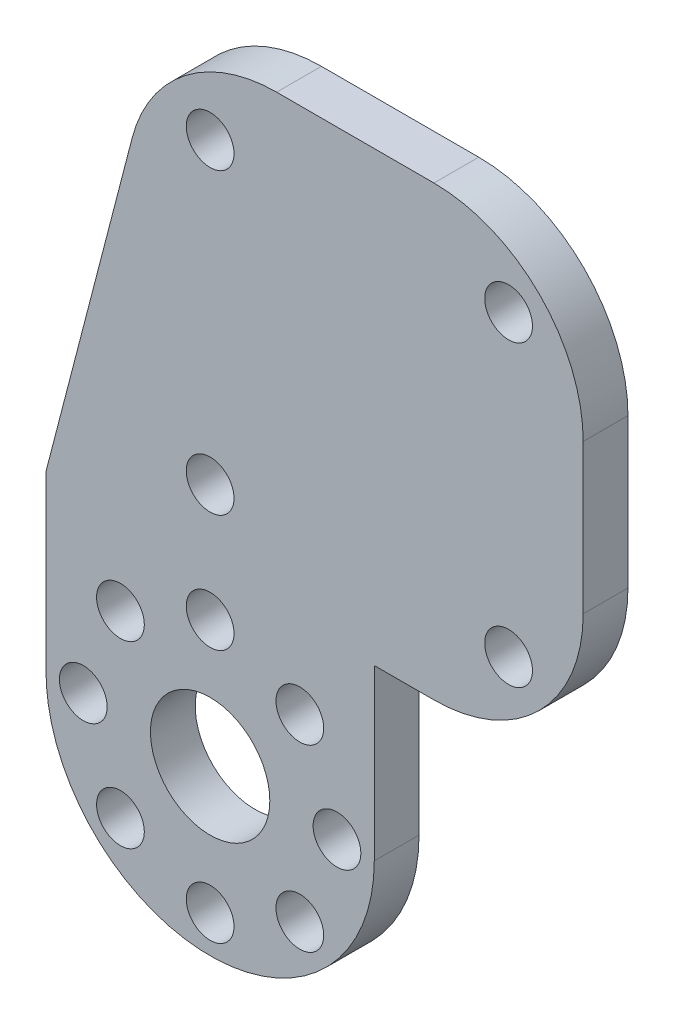
ISO-10303-21;
HEADER;
FILE_DESCRIPTION(('STEP AP214'),'2;1');
FILE_NAME('part.step','',(''),(''),'','','');
FILE_SCHEMA(('AUTOMOTIVE_DESIGN { 1 0 10303 214 1 1 1 1 }'));
ENDSEC;
DATA;
#1=APPLICATION_CONTEXT('core data for automotive mechanical design processes');
#2=APPLICATION_PROTOCOL_DEFINITION('international standard','automotive_design',2000,#1);
#3=PRODUCT_CONTEXT('',#1,'mechanical');
#4=PRODUCT('Part','Part','',(#3));
#5=PRODUCT_RELATED_PRODUCT_CATEGORY('part','',(#4));
#6=PRODUCT_DEFINITION_FORMATION('','',#4);
#7=PRODUCT_DEFINITION_CONTEXT('part definition',#1,'design');
#8=PRODUCT_DEFINITION('design','',#6,#7);
#9=PRODUCT_DEFINITION_SHAPE('','',#8);
#10=(LENGTH_UNIT() NAMED_UNIT(*) SI_UNIT(.MILLI.,.METRE.));
#11=(NAMED_UNIT(*) PLANE_ANGLE_UNIT() SI_UNIT($,.RADIAN.));
#12=(NAMED_UNIT(*) SI_UNIT($,.STERADIAN.) SOLID_ANGLE_UNIT());
#13=UNCERTAINTY_MEASURE_WITH_UNIT(LENGTH_MEASURE(1.E-05),#10,'distance_accuracy_value','');
#14=(GEOMETRIC_REPRESENTATION_CONTEXT(3) GLOBAL_UNCERTAINTY_ASSIGNED_CONTEXT((#13)) GLOBAL_UNIT_ASSIGNED_CONTEXT((#10,
#11,#12)) REPRESENTATION_CONTEXT('',''));
#15=CARTESIAN_POINT('',(0.,0.,0.));
#16=DIRECTION('',(0.,0.,1.));
#17=DIRECTION('',(1.,0.,0.));
#18=AXIS2_PLACEMENT_3D('',#15,#16,#17);
#19=CARTESIAN_POINT('',(15.,5.,3.));
#20=DIRECTION('',(0.,0.,1.));
#21=DIRECTION('',(1.,0.,0.));
#22=AXIS2_PLACEMENT_3D('',#19,#20,#21);
#23=CYLINDRICAL_SURFACE('',#22,10.);
#24=DIRECTION('',(0.,0.,1.));
#25=VECTOR('',#24,1.);
#26=CARTESIAN_POINT('',(14.9999999999999,-5.,3.));
#27=LINE('',#26,#25);
#28=CARTESIAN_POINT('',(14.9999999999999,-5.,0.));
#29=VERTEX_POINT('',#28);
#30=CARTESIAN_POINT('',(14.9999999999999,-5.,3.));
#31=VERTEX_POINT('',#30);
#32=EDGE_CURVE('E11',#29,#31,#27,.T.);
#33=ORIENTED_EDGE('',*,*,#32,.F.);
#34=CARTESIAN_POINT('',(15.,5.,0.));
#35=DIRECTION('',(0.,0.,1.));
#36=DIRECTION('',(1.,0.,0.));
#37=AXIS2_PLACEMENT_3D('',#34,#35,#36);
#38=CIRCLE('',#37,10.);
#39=CARTESIAN_POINT('',(25.,5.,0.));
#40=VERTEX_POINT('',#39);
#41=EDGE_CURVE('E112',#29,#40,#38,.T.);
#42=ORIENTED_EDGE('',*,*,#41,.T.);
#43=DIRECTION('',(0.,0.,1.));
#44=VECTOR('',#43,1.);
#45=CARTESIAN_POINT('',(25.,5.,3.));
#46=LINE('',#45,#44);
#47=CARTESIAN_POINT('',(25.,5.,3.));
#48=VERTEX_POINT('',#47);
#49=EDGE_CURVE('E47',#40,#48,#46,.T.);
#50=ORIENTED_EDGE('',*,*,#49,.T.);
#51=CARTESIAN_POINT('',(15.,5.,3.));
#52=DIRECTION('',(0.,0.,1.));
#53=DIRECTION('',(1.,0.,0.));
#54=AXIS2_PLACEMENT_3D('',#51,#52,#53);
#55=CIRCLE('',#54,10.);
#56=EDGE_CURVE('E187',#31,#48,#55,.T.);
#57=ORIENTED_EDGE('',*,*,#56,.F.);
#58=EDGE_LOOP('',(#33,#42,#50,#57));
#59=FACE_BOUND('',#58,.T.);
#60=ADVANCED_FACE('F37',(#59),#23,.T.);
#61=CARTESIAN_POINT('',(25.,14.9999999999999,3.));
#62=DIRECTION('',(1.,0.,0.));
#63=DIRECTION('',(0.,1.,0.));
#64=AXIS2_PLACEMENT_3D('',#61,#62,#63);
#65=PLANE('',#64);
#66=ORIENTED_EDGE('',*,*,#49,.F.);
#67=DIRECTION('',(0.,1.,0.));
#68=VECTOR('',#67,1.);
#69=CARTESIAN_POINT('',(25.,-16.35,0.));
#70=LINE('',#69,#68);
#71=CARTESIAN_POINT('',(25.,14.9999999999999,0.));
#72=VERTEX_POINT('',#71);
#73=EDGE_CURVE('E140',#40,#72,#70,.T.);
#74=ORIENTED_EDGE('',*,*,#73,.T.);
#75=DIRECTION('',(0.,0.,1.));
#76=VECTOR('',#75,1.);
#77=CARTESIAN_POINT('',(25.,14.9999999999999,3.));
#78=LINE('',#77,#76);
#79=CARTESIAN_POINT('',(25.,14.9999999999999,3.));
#80=VERTEX_POINT('',#79);
#81=EDGE_CURVE('E180',#72,#80,#78,.T.);
#82=ORIENTED_EDGE('',*,*,#81,.T.);
#83=DIRECTION('',(0.,1.,0.));
#84=VECTOR('',#83,1.);
#85=CARTESIAN_POINT('',(25.,14.9999999999999,3.));
#86=LINE('',#85,#84);
#87=EDGE_CURVE('E197',#48,#80,#86,.T.);
#88=ORIENTED_EDGE('',*,*,#87,.F.);
#89=EDGE_LOOP('',(#66,#74,#82,#88));
#90=FACE_BOUND('',#89,.T.);
#91=ADVANCED_FACE('F200',(#90),#65,.T.);
#92=CARTESIAN_POINT('',(15.,15.,3.));
#93=DIRECTION('',(0.,0.,1.));
#94=DIRECTION('',(1.,0.,0.));
#95=AXIS2_PLACEMENT_3D('',#92,#93,#94);
#96=CYLINDRICAL_SURFACE('',#95,10.);
#97=ORIENTED_EDGE('',*,*,#81,.F.);
#98=CARTESIAN_POINT('',(15.,15.,0.));
#99=DIRECTION('',(0.,0.,1.));
#100=DIRECTION('',(1.,0.,0.));
#101=AXIS2_PLACEMENT_3D('',#98,#99,#100);
#102=CIRCLE('',#101,10.);
#103=CARTESIAN_POINT('',(14.9999999999999,25.,0.));
#104=VERTEX_POINT('',#103);
#105=EDGE_CURVE('E137',#72,#104,#102,.T.);
#106=ORIENTED_EDGE('',*,*,#105,.T.);
#107=DIRECTION('',(0.,0.,1.));
#108=VECTOR('',#107,1.);
#109=CARTESIAN_POINT('',(14.9999999999999,25.,3.));
#110=LINE('',#109,#108);
#111=CARTESIAN_POINT('',(14.9999999999999,25.,3.));
#112=VERTEX_POINT('',#111);
#113=EDGE_CURVE('E177',#104,#112,#110,.T.);
#114=ORIENTED_EDGE('',*,*,#113,.T.);
#115=CARTESIAN_POINT('',(15.,15.,3.));
#116=DIRECTION('',(0.,0.,1.));
#117=DIRECTION('',(-1.,0.,0.));
#118=AXIS2_PLACEMENT_3D('',#115,#116,#117);
#119=CIRCLE('',#118,10.);
#120=EDGE_CURVE('E201',#80,#112,#119,.T.);
#121=ORIENTED_EDGE('',*,*,#120,.F.);
#122=EDGE_LOOP('',(#97,#106,#114,#121));
#123=FACE_BOUND('',#122,.T.);
#124=ADVANCED_FACE('F278',(#123),#96,.T.);
#125=CARTESIAN_POINT('',(4.45703970012392,25.,3.));
#126=DIRECTION('',(0.,1.,0.));
#127=DIRECTION('',(-1.,0.,0.));
#128=AXIS2_PLACEMENT_3D('',#125,#126,#127);
#129=PLANE('',#128);
#130=ORIENTED_EDGE('',*,*,#113,.F.);
#131=DIRECTION('',(1.,0.,0.));
#132=VECTOR('',#131,1.);
#133=CARTESIAN_POINT('',(0.,25.,0.));
#134=LINE('',#133,#132);
#135=CARTESIAN_POINT('',(4.45703970012392,25.,0.));
#136=VERTEX_POINT('',#135);
#137=EDGE_CURVE('E134',#104,#136,#134,.F.);
#138=ORIENTED_EDGE('',*,*,#137,.T.);
#139=DIRECTION('',(0.,0.,1.));
#140=VECTOR('',#139,1.);
#141=CARTESIAN_POINT('',(4.45703970012392,25.,3.));
#142=LINE('',#141,#140);
#143=CARTESIAN_POINT('',(4.45703970012392,25.,3.));
#144=VERTEX_POINT('',#143);
#145=EDGE_CURVE('E174',#136,#144,#142,.T.);
#146=ORIENTED_EDGE('',*,*,#145,.T.);
#147=DIRECTION('',(-1.,0.,0.));
#148=VECTOR('',#147,1.);
#149=CARTESIAN_POINT('',(4.45703970012392,25.,3.));
#150=LINE('',#149,#148);
#151=EDGE_CURVE('E203',#112,#144,#150,.T.);
#152=ORIENTED_EDGE('',*,*,#151,.F.);
#153=EDGE_LOOP('',(#130,#138,#146,#152));
#154=FACE_BOUND('',#153,.T.);
#155=ADVANCED_FACE('F389',(#154),#129,.T.);
#156=CARTESIAN_POINT('',(4.45703970012386,15.,3.));
#157=DIRECTION('',(0.,0.,1.));
#158=DIRECTION('',(1.,0.,0.));
#159=AXIS2_PLACEMENT_3D('',#156,#157,#158);
#160=CYLINDRICAL_SURFACE('',#159,10.);
#161=ORIENTED_EDGE('',*,*,#145,.F.);
#162=CARTESIAN_POINT('',(4.45703970012386,15.,0.));
#163=DIRECTION('',(0.,0.,1.));
#164=DIRECTION('',(1.,0.,0.));
#165=AXIS2_PLACEMENT_3D('',#162,#163,#164);
#166=CIRCLE('',#165,10.);
#167=CARTESIAN_POINT('',(-5.22197244511067,17.5133093507172,0.));
#168=VERTEX_POINT('',#167);
#169=EDGE_CURVE('E131',#136,#168,#166,.T.);
#170=ORIENTED_EDGE('',*,*,#169,.T.);
#171=DIRECTION('',(0.,0.,1.));
#172=VECTOR('',#171,1.);
#173=CARTESIAN_POINT('',(-5.22197244511067,17.5133093507172,3.));
#174=LINE('',#173,#172);
#175=CARTESIAN_POINT('',(-5.22197244511067,17.5133093507172,3.));
#176=VERTEX_POINT('',#175);
#177=EDGE_CURVE('E171',#168,#176,#174,.T.);
#178=ORIENTED_EDGE('',*,*,#177,.T.);
#179=CARTESIAN_POINT('',(4.45703970012386,15.,3.));
#180=DIRECTION('',(0.,0.,1.));
#181=DIRECTION('',(1.,0.,0.));
#182=AXIS2_PLACEMENT_3D('',#179,#180,#181);
#183=CIRCLE('',#182,10.);
#184=EDGE_CURVE('E209',#144,#176,#183,.T.);
#185=ORIENTED_EDGE('',*,*,#184,.F.);
#186=EDGE_LOOP('',(#161,#170,#178,#185));
#187=FACE_BOUND('',#186,.T.);
#188=ADVANCED_FACE('F386',(#187),#160,.T.);
#189=CARTESIAN_POINT('',(-5.22197244511066,17.5133093507172,3.));
#190=DIRECTION('',(-0.967901214523452,0.251330935071725,0.));
#191=DIRECTION('',(-0.251330935071725,-0.967901214523451,0.));
#192=AXIS2_PLACEMENT_3D('',#189,#190,#191);
#193=PLANE('',#192);
#194=ORIENTED_EDGE('',*,*,#177,.F.);
#195=DIRECTION('',(-0.251330935071725,-0.967901214523451,0.));
#196=VECTOR('',#195,1.);
#197=CARTESIAN_POINT('',(-5.22197244511066,17.5133093507172,0.));
#198=LINE('',#197,#196);
#199=CARTESIAN_POINT('',(-10.9963498840091,-4.72441054887112,0.));
#200=VERTEX_POINT('',#199);
#201=EDGE_CURVE('E128',#168,#200,#198,.T.);
#202=ORIENTED_EDGE('',*,*,#201,.T.);
#203=DIRECTION('',(0.,0.,1.));
#204=VECTOR('',#203,1.);
#205=CARTESIAN_POINT('',(-10.9963498840091,-4.72441054887112,3.));
#206=LINE('',#205,#204);
#207=CARTESIAN_POINT('',(-10.9963498840091,-4.72441054887112,3.));
#208=VERTEX_POINT('',#207);
#209=EDGE_CURVE('E168',#200,#208,#206,.T.);
#210=ORIENTED_EDGE('',*,*,#209,.T.);
#211=DIRECTION('',(-0.251330935071725,-0.967901214523451,0.));
#212=VECTOR('',#211,1.);
#213=CARTESIAN_POINT('',(-5.22197244511066,17.5133093507172,3.));
#214=LINE('',#213,#212);
#215=EDGE_CURVE('E212',#176,#208,#214,.T.);
#216=ORIENTED_EDGE('',*,*,#215,.F.);
#217=EDGE_LOOP('',(#194,#202,#210,#216));
#218=FACE_BOUND('',#217,.T.);
#219=ADVANCED_FACE('F375',(#218),#193,.T.);
#220=CARTESIAN_POINT('',(-10.9963498840091,-4.72441054887112,3.));
#221=DIRECTION('',(-1.,0.,0.));
#222=DIRECTION('',(0.,-1.,0.));
#223=AXIS2_PLACEMENT_3D('',#220,#221,#222);
#224=PLANE('',#223);
#225=ORIENTED_EDGE('',*,*,#209,.F.);
#226=DIRECTION('',(0.,1.,0.));
#227=VECTOR('',#226,1.);
#228=CARTESIAN_POINT('',(-10.9963498840091,-16.35,0.));
#229=LINE('',#228,#227);
#230=CARTESIAN_POINT('',(-10.9963498840091,-16.0666464603144,0.));
#231=VERTEX_POINT('',#230);
#232=EDGE_CURVE('E125',#200,#231,#229,.F.);
#233=ORIENTED_EDGE('',*,*,#232,.T.);
#234=DIRECTION('',(0.,0.,1.));
#235=VECTOR('',#234,1.);
#236=CARTESIAN_POINT('',(-10.9963498840091,-16.0666464603143,3.));
#237=LINE('',#236,#235);
#238=CARTESIAN_POINT('',(-10.9963498840091,-16.0666464603143,3.));
#239=VERTEX_POINT('',#238);
#240=EDGE_CURVE('E166',#231,#239,#237,.T.);
#241=ORIENTED_EDGE('',*,*,#240,.T.);
#242=DIRECTION('',(0.,-1.,0.));
#243=VECTOR('',#242,1.);
#244=CARTESIAN_POINT('',(-10.9963498840091,-4.72441054887112,3.));
#245=LINE('',#244,#243);
#246=EDGE_CURVE('E215',#208,#239,#245,.T.);
#247=ORIENTED_EDGE('',*,*,#246,.F.);
#248=EDGE_LOOP('',(#225,#233,#241,#247));
#249=FACE_BOUND('',#248,.T.);
#250=ADVANCED_FACE('F381',(#249),#224,.T.);
#251=CARTESIAN_POINT('',(0.,-16.35,3.));
#252=DIRECTION('',(0.,0.,1.));
#253=DIRECTION('',(1.,0.,0.));
#254=AXIS2_PLACEMENT_3D('',#251,#252,#253);
#255=CYLINDRICAL_SURFACE('',#254,11.);
#256=ORIENTED_EDGE('',*,*,#240,.F.);
#257=CARTESIAN_POINT('',(0.,-16.35,0.));
#258=DIRECTION('',(0.,0.,1.));
#259=DIRECTION('',(1.,0.,0.));
#260=AXIS2_PLACEMENT_3D('',#257,#258,#259);
#261=CIRCLE('',#260,11.);
#262=CARTESIAN_POINT('',(10.999997259951,-16.3422359114433,0.));
#263=VERTEX_POINT('',#262);
#264=EDGE_CURVE('E122',#231,#263,#261,.T.);
#265=ORIENTED_EDGE('',*,*,#264,.T.);
#266=DIRECTION('',(0.,0.,1.));
#267=VECTOR('',#266,1.);
#268=CARTESIAN_POINT('',(10.999997259951,-16.3422359114433,3.));
#269=LINE('',#268,#267);
#270=CARTESIAN_POINT('',(10.999997259951,-16.3422359114433,3.));
#271=VERTEX_POINT('',#270);
#272=EDGE_CURVE('E55',#263,#271,#269,.T.);
#273=ORIENTED_EDGE('',*,*,#272,.T.);
#274=CARTESIAN_POINT('',(0.,-16.35,3.));
#275=DIRECTION('',(0.,0.,1.));
#276=DIRECTION('',(1.,0.,0.));
#277=AXIS2_PLACEMENT_3D('',#274,#275,#276);
#278=CIRCLE('',#277,11.);
#279=EDGE_CURVE('E218',#239,#271,#278,.T.);
#280=ORIENTED_EDGE('',*,*,#279,.F.);
#281=EDGE_LOOP('',(#256,#265,#273,#280));
#282=FACE_BOUND('',#281,.T.);
#283=ADVANCED_FACE('F382',(#282),#255,.T.);
#284=CARTESIAN_POINT('',(10.999997259951,-5.,3.));
#285=DIRECTION('',(1.,0.,0.));
#286=DIRECTION('',(0.,1.,0.));
#287=AXIS2_PLACEMENT_3D('',#284,#285,#286);
#288=PLANE('',#287);
#289=ORIENTED_EDGE('',*,*,#272,.F.);
#290=DIRECTION('',(0.,1.,0.));
#291=VECTOR('',#290,1.);
#292=CARTESIAN_POINT('',(10.999997259951,-16.35,0.));
#293=LINE('',#292,#291);
#294=CARTESIAN_POINT('',(10.999997259951,-5.,0.));
#295=VERTEX_POINT('',#294);
#296=EDGE_CURVE('E110',#263,#295,#293,.T.);
#297=ORIENTED_EDGE('',*,*,#296,.T.);
#298=DIRECTION('',(0.,0.,1.));
#299=VECTOR('',#298,1.);
#300=CARTESIAN_POINT('',(10.999997259951,-5.,3.));
#301=LINE('',#300,#299);
#302=CARTESIAN_POINT('',(10.999997259951,-5.,3.));
#303=VERTEX_POINT('',#302);
#304=EDGE_CURVE('E41',#295,#303,#301,.T.);
#305=ORIENTED_EDGE('',*,*,#304,.T.);
#306=DIRECTION('',(0.,1.,0.));
#307=VECTOR('',#306,1.);
#308=CARTESIAN_POINT('',(10.999997259951,-5.,3.));
#309=LINE('',#308,#307);
#310=EDGE_CURVE('E363',#271,#303,#309,.T.);
#311=ORIENTED_EDGE('',*,*,#310,.F.);
#312=EDGE_LOOP('',(#289,#297,#305,#311));
#313=FACE_BOUND('',#312,.T.);
#314=ADVANCED_FACE('F114',(#313),#288,.T.);
#315=CARTESIAN_POINT('',(0.,-7.85,3.));
#316=DIRECTION('',(0.,0.,1.));
#317=DIRECTION('',(1.,0.,0.));
#318=AXIS2_PLACEMENT_3D('',#315,#316,#317);
#319=CYLINDRICAL_SURFACE('',#318,1.59999999999998);
#320=CARTESIAN_POINT('',(0.,-7.85,3.));
#321=DIRECTION('',(0.,0.,1.));
#322=DIRECTION('',(1.,0.,0.));
#323=AXIS2_PLACEMENT_3D('',#320,#321,#322);
#324=CIRCLE('',#323,1.59999999999998);
#325=CARTESIAN_POINT('',(1.59999999999998,-7.85,3.));
#326=VERTEX_POINT('',#325);
#327=EDGE_CURVE('E164',#326,#326,#324,.T.);
#328=ORIENTED_EDGE('',*,*,#327,.T.);
#329=EDGE_LOOP('',(#328));
#330=FACE_BOUND('',#329,.T.);
#331=CARTESIAN_POINT('',(0.,-7.85,0.));
#332=DIRECTION('',(0.,0.,1.));
#333=DIRECTION('',(1.,0.,0.));
#334=AXIS2_PLACEMENT_3D('',#331,#332,#333);
#335=CIRCLE('',#334,1.59999999999998);
#336=CARTESIAN_POINT('',(1.59999999999998,-7.85,0.));
#337=VERTEX_POINT('',#336);
#338=EDGE_CURVE('E241',#337,#337,#335,.T.);
#339=ORIENTED_EDGE('',*,*,#338,.F.);
#340=EDGE_LOOP('',(#339));
#341=FACE_BOUND('',#340,.T.);
#342=ADVANCED_FACE('F327',(#330,#341),#319,.F.);
#343=CARTESIAN_POINT('',(-8.5,-16.35,3.));
#344=DIRECTION('',(0.,0.,1.));
#345=DIRECTION('',(1.,0.,0.));
#346=AXIS2_PLACEMENT_3D('',#343,#344,#345);
#347=CYLINDRICAL_SURFACE('',#346,1.6);
#348=CARTESIAN_POINT('',(-8.5,-16.35,3.));
#349=DIRECTION('',(0.,0.,1.));
#350=DIRECTION('',(1.,0.,0.));
#351=AXIS2_PLACEMENT_3D('',#348,#349,#350);
#352=CIRCLE('',#351,1.6);
#353=CARTESIAN_POINT('',(-6.9,-16.35,3.));
#354=VERTEX_POINT('',#353);
#355=EDGE_CURVE('E350',#354,#354,#352,.T.);
#356=ORIENTED_EDGE('',*,*,#355,.T.);
#357=EDGE_LOOP('',(#356));
#358=FACE_BOUND('',#357,.T.);
#359=CARTESIAN_POINT('',(-8.5,-16.35,0.));
#360=DIRECTION('',(0.,0.,1.));
#361=DIRECTION('',(1.,0.,0.));
#362=AXIS2_PLACEMENT_3D('',#359,#360,#361);
#363=CIRCLE('',#362,1.6);
#364=CARTESIAN_POINT('',(-6.9,-16.35,0.));
#365=VERTEX_POINT('',#364);
#366=EDGE_CURVE('E244',#365,#365,#363,.T.);
#367=ORIENTED_EDGE('',*,*,#366,.F.);
#368=EDGE_LOOP('',(#367));
#369=FACE_BOUND('',#368,.T.);
#370=ADVANCED_FACE('F330',(#358,#369),#347,.F.);
#371=CARTESIAN_POINT('',(0.,-24.85,3.));
#372=DIRECTION('',(0.,0.,1.));
#373=DIRECTION('',(1.,0.,0.));
#374=AXIS2_PLACEMENT_3D('',#371,#372,#373);
#375=CYLINDRICAL_SURFACE('',#374,1.6);
#376=CARTESIAN_POINT('',(0.,-24.85,3.));
#377=DIRECTION('',(0.,0.,1.));
#378=DIRECTION('',(1.,0.,0.));
#379=AXIS2_PLACEMENT_3D('',#376,#377,#378);
#380=CIRCLE('',#379,1.6);
#381=CARTESIAN_POINT('',(1.6,-24.85,3.));
#382=VERTEX_POINT('',#381);
#383=EDGE_CURVE('E342',#382,#382,#380,.T.);
#384=ORIENTED_EDGE('',*,*,#383,.T.);
#385=EDGE_LOOP('',(#384));
#386=FACE_BOUND('',#385,.T.);
#387=CARTESIAN_POINT('',(0.,-24.85,0.));
#388=DIRECTION('',(0.,0.,1.));
#389=DIRECTION('',(1.,0.,0.));
#390=AXIS2_PLACEMENT_3D('',#387,#388,#389);
#391=CIRCLE('',#390,1.6);
#392=CARTESIAN_POINT('',(1.6,-24.85,0.));
#393=VERTEX_POINT('',#392);
#394=EDGE_CURVE('E247',#393,#393,#391,.T.);
#395=ORIENTED_EDGE('',*,*,#394,.F.);
#396=EDGE_LOOP('',(#395));
#397=FACE_BOUND('',#396,.T.);
#398=ADVANCED_FACE('F269',(#386,#397),#375,.F.);
#399=CARTESIAN_POINT('',(8.5,-16.35,3.));
#400=DIRECTION('',(0.,0.,1.));
#401=DIRECTION('',(1.,0.,0.));
#402=AXIS2_PLACEMENT_3D('',#399,#400,#401);
#403=CYLINDRICAL_SURFACE('',#402,1.6);
#404=CARTESIAN_POINT('',(8.5,-16.35,3.));
#405=DIRECTION('',(0.,0.,1.));
#406=DIRECTION('',(1.,0.,0.));
#407=AXIS2_PLACEMENT_3D('',#404,#405,#406);
#408=CIRCLE('',#407,1.6);
#409=CARTESIAN_POINT('',(10.1,-16.35,3.));
#410=VERTEX_POINT('',#409);
#411=EDGE_CURVE('E349',#410,#410,#408,.T.);
#412=ORIENTED_EDGE('',*,*,#411,.T.);
#413=EDGE_LOOP('',(#412));
#414=FACE_BOUND('',#413,.T.);
#415=CARTESIAN_POINT('',(8.5,-16.35,0.));
#416=DIRECTION('',(0.,0.,1.));
#417=DIRECTION('',(1.,0.,0.));
#418=AXIS2_PLACEMENT_3D('',#415,#416,#417);
#419=CIRCLE('',#418,1.6);
#420=CARTESIAN_POINT('',(10.1,-16.35,0.));
#421=VERTEX_POINT('',#420);
#422=EDGE_CURVE('E250',#421,#421,#419,.T.);
#423=ORIENTED_EDGE('',*,*,#422,.F.);
#424=EDGE_LOOP('',(#423));
#425=FACE_BOUND('',#424,.T.);
#426=ADVANCED_FACE('F260',(#414,#425),#403,.F.);
#427=CARTESIAN_POINT('',(0.,0.,3.));
#428=DIRECTION('',(0.,0.,1.));
#429=DIRECTION('',(1.,0.,0.));
#430=AXIS2_PLACEMENT_3D('',#427,#428,#429);
#431=CYLINDRICAL_SURFACE('',#430,1.6);
#432=CARTESIAN_POINT('',(0.,0.,3.));
#433=DIRECTION('',(0.,0.,1.));
#434=DIRECTION('',(1.,0.,0.));
#435=AXIS2_PLACEMENT_3D('',#432,#433,#434);
#436=CIRCLE('',#435,1.6);
#437=CARTESIAN_POINT('',(1.6,0.,3.));
#438=VERTEX_POINT('',#437);
#439=EDGE_CURVE('E353',#438,#438,#436,.T.);
#440=ORIENTED_EDGE('',*,*,#439,.T.);
#441=EDGE_LOOP('',(#440));
#442=FACE_BOUND('',#441,.T.);
#443=CARTESIAN_POINT('',(0.,0.,0.));
#444=DIRECTION('',(0.,0.,1.));
#445=DIRECTION('',(1.,0.,0.));
#446=AXIS2_PLACEMENT_3D('',#443,#444,#445);
#447=CIRCLE('',#446,1.6);
#448=CARTESIAN_POINT('',(1.6,0.,0.));
#449=VERTEX_POINT('',#448);
#450=EDGE_CURVE('E118',#449,#449,#447,.T.);
#451=ORIENTED_EDGE('',*,*,#450,.F.);
#452=EDGE_LOOP('',(#451));
#453=FACE_BOUND('',#452,.T.);
#454=ADVANCED_FACE('F257',(#442,#453),#431,.F.);
#455=CARTESIAN_POINT('',(0.,-16.35,3.));
#456=DIRECTION('',(0.,0.,1.));
#457=DIRECTION('',(1.,0.,0.));
#458=AXIS2_PLACEMENT_3D('',#455,#456,#457);
#459=CYLINDRICAL_SURFACE('',#458,4.);
#460=CARTESIAN_POINT('',(0.,-16.35,3.));
#461=DIRECTION('',(0.,0.,1.));
#462=DIRECTION('',(1.,0.,0.));
#463=AXIS2_PLACEMENT_3D('',#460,#461,#462);
#464=CIRCLE('',#463,4.);
#465=CARTESIAN_POINT('',(4.,-16.35,3.));
#466=VERTEX_POINT('',#465);
#467=EDGE_CURVE('E360',#466,#466,#464,.T.);
#468=ORIENTED_EDGE('',*,*,#467,.T.);
#469=EDGE_LOOP('',(#468));
#470=FACE_BOUND('',#469,.T.);
#471=CARTESIAN_POINT('',(0.,-16.35,0.));
#472=DIRECTION('',(0.,0.,1.));
#473=DIRECTION('',(1.,0.,0.));
#474=AXIS2_PLACEMENT_3D('',#471,#472,#473);
#475=CIRCLE('',#474,4.);
#476=CARTESIAN_POINT('',(4.,-16.35,0.));
#477=VERTEX_POINT('',#476);
#478=EDGE_CURVE('E115',#477,#477,#475,.T.);
#479=ORIENTED_EDGE('',*,*,#478,.F.);
#480=EDGE_LOOP('',(#479));
#481=FACE_BOUND('',#480,.T.);
#482=ADVANCED_FACE('F259',(#470,#481),#459,.F.);
#483=CARTESIAN_POINT('',(10.999997259951,-5.,3.));
#484=DIRECTION('',(0.,-1.,0.));
#485=DIRECTION('',(1.,0.,0.));
#486=AXIS2_PLACEMENT_3D('',#483,#484,#485);
#487=PLANE('',#486);
#488=DIRECTION('',(1.,0.,0.));
#489=VECTOR('',#488,1.);
#490=CARTESIAN_POINT('',(0.,-5.,0.));
#491=LINE('',#490,#489);
#492=EDGE_CURVE('E98',#295,#29,#491,.T.);
#493=ORIENTED_EDGE('',*,*,#492,.T.);
#494=ORIENTED_EDGE('',*,*,#32,.T.);
#495=DIRECTION('',(1.,0.,0.));
#496=VECTOR('',#495,1.);
#497=CARTESIAN_POINT('',(10.999997259951,-5.,3.));
#498=LINE('',#497,#496);
#499=EDGE_CURVE('E100',#303,#31,#498,.T.);
#500=ORIENTED_EDGE('',*,*,#499,.F.);
#501=ORIENTED_EDGE('',*,*,#304,.F.);
#502=EDGE_LOOP('',(#493,#494,#500,#501));
#503=FACE_BOUND('',#502,.T.);
#504=ADVANCED_FACE('F97',(#503),#487,.T.);
#505=CARTESIAN_POINT('',(20.,20.,3.));
#506=DIRECTION('',(0.,0.,1.));
#507=DIRECTION('',(1.,0.,0.));
#508=AXIS2_PLACEMENT_3D('',#505,#506,#507);
#509=CYLINDRICAL_SURFACE('',#508,1.6);
#510=CARTESIAN_POINT('',(20.,20.,3.));
#511=DIRECTION('',(0.,0.,1.));
#512=DIRECTION('',(1.,0.,0.));
#513=AXIS2_PLACEMENT_3D('',#510,#511,#512);
#514=CIRCLE('',#513,1.6);
#515=CARTESIAN_POINT('',(21.6,20.,3.));
#516=VERTEX_POINT('',#515);
#517=EDGE_CURVE('E221',#516,#516,#514,.T.);
#518=ORIENTED_EDGE('',*,*,#517,.T.);
#519=EDGE_LOOP('',(#518));
#520=FACE_BOUND('',#519,.T.);
#521=CARTESIAN_POINT('',(20.,20.,0.));
#522=DIRECTION('',(0.,0.,1.));
#523=DIRECTION('',(1.,0.,0.));
#524=AXIS2_PLACEMENT_3D('',#521,#522,#523);
#525=CIRCLE('',#524,1.6);
#526=CARTESIAN_POINT('',(21.6,20.,0.));
#527=VERTEX_POINT('',#526);
#528=EDGE_CURVE('E124',#527,#527,#525,.T.);
#529=ORIENTED_EDGE('',*,*,#528,.F.);
#530=EDGE_LOOP('',(#529));
#531=FACE_BOUND('',#530,.T.);
#532=ADVANCED_FACE('F284',(#520,#531),#509,.F.);
#533=CARTESIAN_POINT('',(0.,20.,3.));
#534=DIRECTION('',(0.,0.,1.));
#535=DIRECTION('',(1.,0.,0.));
#536=AXIS2_PLACEMENT_3D('',#533,#534,#535);
#537=CYLINDRICAL_SURFACE('',#536,1.6);
#538=CARTESIAN_POINT('',(0.,20.,3.));
#539=DIRECTION('',(0.,0.,1.));
#540=DIRECTION('',(1.,0.,0.));
#541=AXIS2_PLACEMENT_3D('',#538,#539,#540);
#542=CIRCLE('',#541,1.6);
#543=CARTESIAN_POINT('',(1.6,20.,3.));
#544=VERTEX_POINT('',#543);
#545=EDGE_CURVE('E224',#544,#544,#542,.T.);
#546=ORIENTED_EDGE('',*,*,#545,.T.);
#547=EDGE_LOOP('',(#546));
#548=FACE_BOUND('',#547,.T.);
#549=CARTESIAN_POINT('',(0.,20.,0.));
#550=DIRECTION('',(0.,0.,1.));
#551=DIRECTION('',(1.,0.,0.));
#552=AXIS2_PLACEMENT_3D('',#549,#550,#551);
#553=CIRCLE('',#552,1.6);
#554=CARTESIAN_POINT('',(1.6,20.,0.));
#555=VERTEX_POINT('',#554);
#556=EDGE_CURVE('E146',#555,#555,#553,.T.);
#557=ORIENTED_EDGE('',*,*,#556,.F.);
#558=EDGE_LOOP('',(#557));
#559=FACE_BOUND('',#558,.T.);
#560=ADVANCED_FACE('F287',(#548,#559),#537,.F.);
#561=CARTESIAN_POINT('',(20.,0.,3.));
#562=DIRECTION('',(0.,0.,1.));
#563=DIRECTION('',(1.,0.,0.));
#564=AXIS2_PLACEMENT_3D('',#561,#562,#563);
#565=CYLINDRICAL_SURFACE('',#564,1.6);
#566=CARTESIAN_POINT('',(20.,0.,3.));
#567=DIRECTION('',(0.,0.,1.));
#568=DIRECTION('',(1.,0.,0.));
#569=AXIS2_PLACEMENT_3D('',#566,#567,#568);
#570=CIRCLE('',#569,1.6);
#571=CARTESIAN_POINT('',(21.6,0.,3.));
#572=VERTEX_POINT('',#571);
#573=EDGE_CURVE('E227',#572,#572,#570,.T.);
#574=ORIENTED_EDGE('',*,*,#573,.T.);
#575=EDGE_LOOP('',(#574));
#576=FACE_BOUND('',#575,.T.);
#577=CARTESIAN_POINT('',(20.,0.,0.));
#578=DIRECTION('',(0.,0.,1.));
#579=DIRECTION('',(1.,0.,0.));
#580=AXIS2_PLACEMENT_3D('',#577,#578,#579);
#581=CIRCLE('',#580,1.6);
#582=CARTESIAN_POINT('',(21.6,0.,0.));
#583=VERTEX_POINT('',#582);
#584=EDGE_CURVE('E149',#583,#583,#581,.T.);
#585=ORIENTED_EDGE('',*,*,#584,.F.);
#586=EDGE_LOOP('',(#585));
#587=FACE_BOUND('',#586,.T.);
#588=ADVANCED_FACE('F291',(#576,#587),#565,.F.);
#589=CARTESIAN_POINT('',(6.01040764008566,-22.3604076400857,3.));
#590=DIRECTION('',(0.,0.,1.));
#591=DIRECTION('',(1.,0.,0.));
#592=AXIS2_PLACEMENT_3D('',#589,#590,#591);
#593=CYLINDRICAL_SURFACE('',#592,1.6);
#594=CARTESIAN_POINT('',(6.01040764008566,-22.3604076400857,3.));
#595=DIRECTION('',(0.,0.,1.));
#596=DIRECTION('',(1.,0.,0.));
#597=AXIS2_PLACEMENT_3D('',#594,#595,#596);
#598=CIRCLE('',#597,1.6);
#599=CARTESIAN_POINT('',(7.61040764008566,-22.3604076400857,3.));
#600=VERTEX_POINT('',#599);
#601=EDGE_CURVE('E230',#600,#600,#598,.T.);
#602=ORIENTED_EDGE('',*,*,#601,.T.);
#603=EDGE_LOOP('',(#602));
#604=FACE_BOUND('',#603,.T.);
#605=CARTESIAN_POINT('',(6.01040764008566,-22.3604076400857,0.));
#606=DIRECTION('',(0.,0.,1.));
#607=DIRECTION('',(1.,0.,0.));
#608=AXIS2_PLACEMENT_3D('',#605,#606,#607);
#609=CIRCLE('',#608,1.6);
#610=CARTESIAN_POINT('',(7.61040764008566,-22.3604076400857,0.));
#611=VERTEX_POINT('',#610);
#612=EDGE_CURVE('E152',#611,#611,#609,.T.);
#613=ORIENTED_EDGE('',*,*,#612,.F.);
#614=EDGE_LOOP('',(#613));
#615=FACE_BOUND('',#614,.T.);
#616=ADVANCED_FACE('F295',(#604,#615),#593,.F.);
#617=CARTESIAN_POINT('',(-6.01040764008565,-22.3604076400857,3.));
#618=DIRECTION('',(0.,0.,1.));
#619=DIRECTION('',(1.,0.,0.));
#620=AXIS2_PLACEMENT_3D('',#617,#618,#619);
#621=CYLINDRICAL_SURFACE('',#620,1.6);
#622=CARTESIAN_POINT('',(-6.01040764008565,-22.3604076400857,3.));
#623=DIRECTION('',(0.,0.,1.));
#624=DIRECTION('',(1.,0.,0.));
#625=AXIS2_PLACEMENT_3D('',#622,#623,#624);
#626=CIRCLE('',#625,1.6);
#627=CARTESIAN_POINT('',(-4.41040764008565,-22.3604076400857,3.));
#628=VERTEX_POINT('',#627);
#629=EDGE_CURVE('E233',#628,#628,#626,.T.);
#630=ORIENTED_EDGE('',*,*,#629,.T.);
#631=EDGE_LOOP('',(#630));
#632=FACE_BOUND('',#631,.T.);
#633=CARTESIAN_POINT('',(-6.01040764008565,-22.3604076400857,0.));
#634=DIRECTION('',(0.,0.,1.));
#635=DIRECTION('',(1.,0.,0.));
#636=AXIS2_PLACEMENT_3D('',#633,#634,#635);
#637=CIRCLE('',#636,1.6);
#638=CARTESIAN_POINT('',(-4.41040764008565,-22.3604076400857,0.));
#639=VERTEX_POINT('',#638);
#640=EDGE_CURVE('E155',#639,#639,#637,.T.);
#641=ORIENTED_EDGE('',*,*,#640,.F.);
#642=EDGE_LOOP('',(#641));
#643=FACE_BOUND('',#642,.T.);
#644=ADVANCED_FACE('F299',(#632,#643),#621,.F.);
#645=CARTESIAN_POINT('',(-6.01040764008565,-10.3395923599143,3.));
#646=DIRECTION('',(0.,0.,1.));
#647=DIRECTION('',(1.,0.,0.));
#648=AXIS2_PLACEMENT_3D('',#645,#646,#647);
#649=CYLINDRICAL_SURFACE('',#648,1.6);
#650=CARTESIAN_POINT('',(-6.01040764008565,-10.3395923599143,3.));
#651=DIRECTION('',(0.,0.,1.));
#652=DIRECTION('',(1.,0.,0.));
#653=AXIS2_PLACEMENT_3D('',#650,#651,#652);
#654=CIRCLE('',#653,1.6);
#655=CARTESIAN_POINT('',(-4.41040764008565,-10.3395923599143,3.));
#656=VERTEX_POINT('',#655);
#657=EDGE_CURVE('E236',#656,#656,#654,.T.);
#658=ORIENTED_EDGE('',*,*,#657,.T.);
#659=EDGE_LOOP('',(#658));
#660=FACE_BOUND('',#659,.T.);
#661=CARTESIAN_POINT('',(-6.01040764008565,-10.3395923599143,0.));
#662=DIRECTION('',(0.,0.,1.));
#663=DIRECTION('',(1.,0.,0.));
#664=AXIS2_PLACEMENT_3D('',#661,#662,#663);
#665=CIRCLE('',#664,1.6);
#666=CARTESIAN_POINT('',(-4.41040764008565,-10.3395923599143,0.));
#667=VERTEX_POINT('',#666);
#668=EDGE_CURVE('E158',#667,#667,#665,.T.);
#669=ORIENTED_EDGE('',*,*,#668,.F.);
#670=EDGE_LOOP('',(#669));
#671=FACE_BOUND('',#670,.T.);
#672=ADVANCED_FACE('F302',(#660,#671),#649,.F.);
#673=CARTESIAN_POINT('',(6.01040764008566,-10.3395923599143,3.));
#674=DIRECTION('',(0.,0.,1.));
#675=DIRECTION('',(1.,0.,0.));
#676=AXIS2_PLACEMENT_3D('',#673,#674,#675);
#677=CYLINDRICAL_SURFACE('',#676,1.6);
#678=CARTESIAN_POINT('',(6.01040764008566,-10.3395923599143,3.));
#679=DIRECTION('',(0.,0.,1.));
#680=DIRECTION('',(1.,0.,0.));
#681=AXIS2_PLACEMENT_3D('',#678,#679,#680);
#682=CIRCLE('',#681,1.6);
#683=CARTESIAN_POINT('',(7.61040764008566,-10.3395923599143,3.));
#684=VERTEX_POINT('',#683);
#685=EDGE_CURVE('E104',#684,#684,#682,.T.);
#686=ORIENTED_EDGE('',*,*,#685,.T.);
#687=EDGE_LOOP('',(#686));
#688=FACE_BOUND('',#687,.T.);
#689=CARTESIAN_POINT('',(6.01040764008566,-10.3395923599143,0.));
#690=DIRECTION('',(0.,0.,1.));
#691=DIRECTION('',(1.,0.,0.));
#692=AXIS2_PLACEMENT_3D('',#689,#690,#691);
#693=CIRCLE('',#692,1.6);
#694=CARTESIAN_POINT('',(7.61040764008566,-10.3395923599143,0.));
#695=VERTEX_POINT('',#694);
#696=EDGE_CURVE('E161',#695,#695,#693,.T.);
#697=ORIENTED_EDGE('',*,*,#696,.F.);
#698=EDGE_LOOP('',(#697));
#699=FACE_BOUND('',#698,.T.);
#700=ADVANCED_FACE('F39',(#688,#699),#677,.F.);
#701=CARTESIAN_POINT('',(0.,-16.35,3.));
#702=DIRECTION('',(0.,0.,1.));
#703=DIRECTION('',(1.,0.,0.));
#704=AXIS2_PLACEMENT_3D('',#701,#702,#703);
#705=PLANE('',#704);
#706=ORIENTED_EDGE('',*,*,#327,.F.);
#707=EDGE_LOOP('',(#706));
#708=FACE_BOUND('',#707,.T.);
#709=ORIENTED_EDGE('',*,*,#355,.F.);
#710=EDGE_LOOP('',(#709));
#711=FACE_BOUND('',#710,.T.);
#712=ORIENTED_EDGE('',*,*,#383,.F.);
#713=EDGE_LOOP('',(#712));
#714=FACE_BOUND('',#713,.T.);
#715=ORIENTED_EDGE('',*,*,#411,.F.);
#716=EDGE_LOOP('',(#715));
#717=FACE_BOUND('',#716,.T.);
#718=ORIENTED_EDGE('',*,*,#439,.F.);
#719=EDGE_LOOP('',(#718));
#720=FACE_BOUND('',#719,.T.);
#721=ORIENTED_EDGE('',*,*,#467,.F.);
#722=EDGE_LOOP('',(#721));
#723=FACE_BOUND('',#722,.T.);
#724=ORIENTED_EDGE('',*,*,#310,.T.);
#725=ORIENTED_EDGE('',*,*,#499,.T.);
#726=ORIENTED_EDGE('',*,*,#56,.T.);
#727=ORIENTED_EDGE('',*,*,#87,.T.);
#728=ORIENTED_EDGE('',*,*,#120,.T.);
#729=ORIENTED_EDGE('',*,*,#151,.T.);
#730=ORIENTED_EDGE('',*,*,#184,.T.);
#731=ORIENTED_EDGE('',*,*,#215,.T.);
#732=ORIENTED_EDGE('',*,*,#246,.T.);
#733=ORIENTED_EDGE('',*,*,#279,.T.);
#734=EDGE_LOOP('',(#724,#725,#726,#727,#728,#729,#730,#731,#732,#733));
#735=FACE_BOUND('',#734,.T.);
#736=ORIENTED_EDGE('',*,*,#517,.F.);
#737=EDGE_LOOP('',(#736));
#738=FACE_BOUND('',#737,.T.);
#739=ORIENTED_EDGE('',*,*,#545,.F.);
#740=EDGE_LOOP('',(#739));
#741=FACE_BOUND('',#740,.T.);
#742=ORIENTED_EDGE('',*,*,#573,.F.);
#743=EDGE_LOOP('',(#742));
#744=FACE_BOUND('',#743,.T.);
#745=ORIENTED_EDGE('',*,*,#601,.F.);
#746=EDGE_LOOP('',(#745));
#747=FACE_BOUND('',#746,.T.);
#748=ORIENTED_EDGE('',*,*,#629,.F.);
#749=EDGE_LOOP('',(#748));
#750=FACE_BOUND('',#749,.T.);
#751=ORIENTED_EDGE('',*,*,#657,.F.);
#752=EDGE_LOOP('',(#751));
#753=FACE_BOUND('',#752,.T.);
#754=ORIENTED_EDGE('',*,*,#685,.F.);
#755=EDGE_LOOP('',(#754));
#756=FACE_BOUND('',#755,.T.);
#757=ADVANCED_FACE('F194',(#708,#711,#714,#717,#720,#723,#735,#738,#741,#744,#747,#750,#753,
#756),#705,.T.);
#758=CARTESIAN_POINT('',(0.,-16.35,0.));
#759=DIRECTION('',(0.,0.,1.));
#760=DIRECTION('',(1.,0.,0.));
#761=AXIS2_PLACEMENT_3D('',#758,#759,#760);
#762=PLANE('',#761);
#763=ORIENTED_EDGE('',*,*,#338,.T.);
#764=EDGE_LOOP('',(#763));
#765=FACE_BOUND('',#764,.T.);
#766=ORIENTED_EDGE('',*,*,#366,.T.);
#767=EDGE_LOOP('',(#766));
#768=FACE_BOUND('',#767,.T.);
#769=ORIENTED_EDGE('',*,*,#394,.T.);
#770=EDGE_LOOP('',(#769));
#771=FACE_BOUND('',#770,.T.);
#772=ORIENTED_EDGE('',*,*,#422,.T.);
#773=EDGE_LOOP('',(#772));
#774=FACE_BOUND('',#773,.T.);
#775=ORIENTED_EDGE('',*,*,#450,.T.);
#776=EDGE_LOOP('',(#775));
#777=FACE_BOUND('',#776,.T.);
#778=ORIENTED_EDGE('',*,*,#478,.T.);
#779=EDGE_LOOP('',(#778));
#780=FACE_BOUND('',#779,.T.);
#781=ORIENTED_EDGE('',*,*,#296,.F.);
#782=ORIENTED_EDGE('',*,*,#264,.F.);
#783=ORIENTED_EDGE('',*,*,#232,.F.);
#784=ORIENTED_EDGE('',*,*,#201,.F.);
#785=ORIENTED_EDGE('',*,*,#169,.F.);
#786=ORIENTED_EDGE('',*,*,#137,.F.);
#787=ORIENTED_EDGE('',*,*,#105,.F.);
#788=ORIENTED_EDGE('',*,*,#73,.F.);
#789=ORIENTED_EDGE('',*,*,#41,.F.);
#790=ORIENTED_EDGE('',*,*,#492,.F.);
#791=EDGE_LOOP('',(#781,#782,#783,#784,#785,#786,#787,#788,#789,#790));
#792=FACE_BOUND('',#791,.T.);
#793=ORIENTED_EDGE('',*,*,#528,.T.);
#794=EDGE_LOOP('',(#793));
#795=FACE_BOUND('',#794,.T.);
#796=ORIENTED_EDGE('',*,*,#556,.T.);
#797=EDGE_LOOP('',(#796));
#798=FACE_BOUND('',#797,.T.);
#799=ORIENTED_EDGE('',*,*,#584,.T.);
#800=EDGE_LOOP('',(#799));
#801=FACE_BOUND('',#800,.T.);
#802=ORIENTED_EDGE('',*,*,#612,.T.);
#803=EDGE_LOOP('',(#802));
#804=FACE_BOUND('',#803,.T.);
#805=ORIENTED_EDGE('',*,*,#640,.T.);
#806=EDGE_LOOP('',(#805));
#807=FACE_BOUND('',#806,.T.);
#808=ORIENTED_EDGE('',*,*,#668,.T.);
#809=EDGE_LOOP('',(#808));
#810=FACE_BOUND('',#809,.T.);
#811=ORIENTED_EDGE('',*,*,#696,.T.);
#812=EDGE_LOOP('',(#811));
#813=FACE_BOUND('',#812,.T.);
#814=ADVANCED_FACE('F107',(#765,#768,#771,#774,#777,#780,#792,#795,#798,#801,#804,#807,#810,
#813),#762,.F.);
#815=CLOSED_SHELL('',(#60,#91,#124,#155,#188,#219,#250,#283,#314,#342,#370,#398,#426,#454,#482,
#504,#532,#560,#588,#616,#644,#672,#700,#757,#814));
#816=MANIFOLD_SOLID_BREP('B2',#815);
#817=ADVANCED_BREP_SHAPE_REPRESENTATION('',(#18,#816),#14);
#818=SHAPE_DEFINITION_REPRESENTATION(#9,#817);
ENDSEC;
END-ISO-10303-21;
